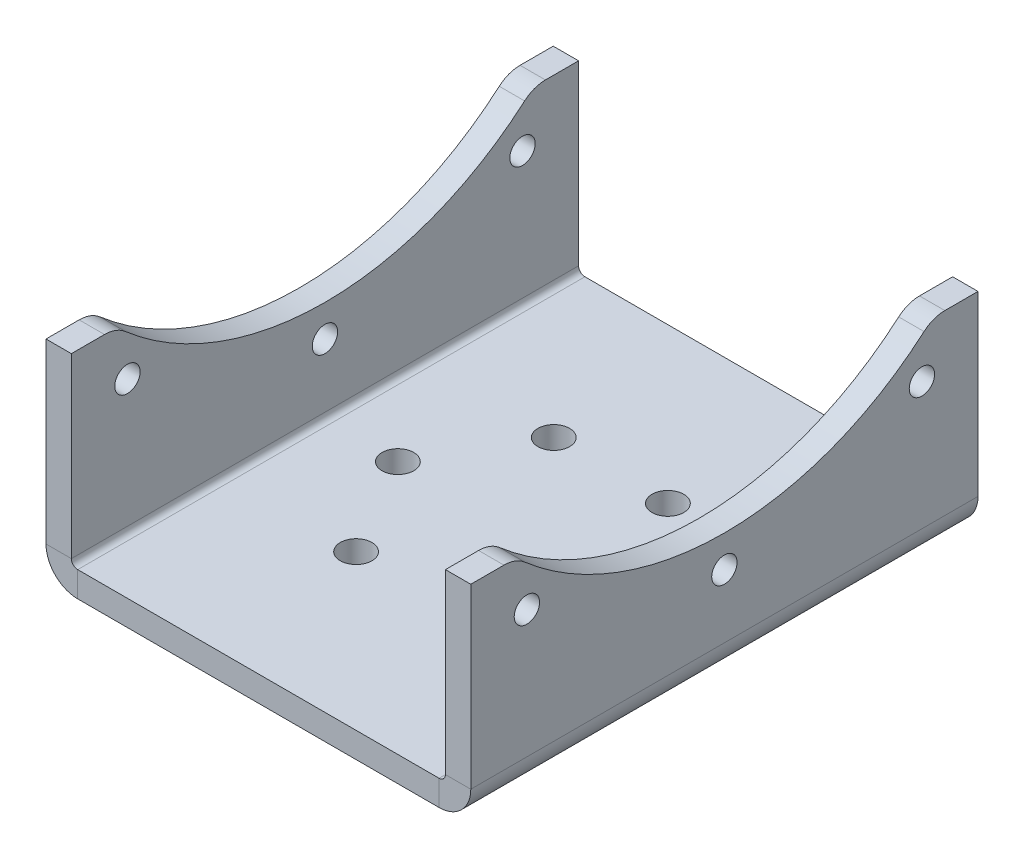
ISO-10303-21;
HEADER;
FILE_DESCRIPTION(('STEP AP214'),'2;1');
FILE_NAME('part.step','',(''),(''),'','','');
FILE_SCHEMA(('AUTOMOTIVE_DESIGN { 1 0 10303 214 1 1 1 1 }'));
ENDSEC;
DATA;
#1=APPLICATION_CONTEXT('core data for automotive mechanical design processes');
#2=APPLICATION_PROTOCOL_DEFINITION('international standard','automotive_design',2000,#1);
#3=PRODUCT_CONTEXT('',#1,'mechanical');
#4=PRODUCT('Part','Part','',(#3));
#5=PRODUCT_RELATED_PRODUCT_CATEGORY('part','',(#4));
#6=PRODUCT_DEFINITION_FORMATION('','',#4);
#7=PRODUCT_DEFINITION_CONTEXT('part definition',#1,'design');
#8=PRODUCT_DEFINITION('design','',#6,#7);
#9=PRODUCT_DEFINITION_SHAPE('','',#8);
#10=(LENGTH_UNIT() NAMED_UNIT(*) SI_UNIT(.MILLI.,.METRE.));
#11=(NAMED_UNIT(*) PLANE_ANGLE_UNIT() SI_UNIT($,.RADIAN.));
#12=(NAMED_UNIT(*) SI_UNIT($,.STERADIAN.) SOLID_ANGLE_UNIT());
#13=UNCERTAINTY_MEASURE_WITH_UNIT(LENGTH_MEASURE(1.E-05),#10,'distance_accuracy_value','');
#14=(GEOMETRIC_REPRESENTATION_CONTEXT(3) GLOBAL_UNCERTAINTY_ASSIGNED_CONTEXT((#13)) GLOBAL_UNIT_ASSIGNED_CONTEXT((#10,
#11,#12)) REPRESENTATION_CONTEXT('',''));
#15=CARTESIAN_POINT('',(0.,0.,0.));
#16=DIRECTION('',(0.,0.,1.));
#17=DIRECTION('',(1.,0.,0.));
#18=AXIS2_PLACEMENT_3D('',#15,#16,#17);
#19=CARTESIAN_POINT('',(-33.5,29.,80.));
#20=DIRECTION('',(0.,1.,0.));
#21=DIRECTION('',(0.,0.,1.));
#22=AXIS2_PLACEMENT_3D('',#19,#20,#21);
#23=PLANE('',#22);
#24=DIRECTION('',(0.,0.,-1.));
#25=VECTOR('',#24,1.);
#26=CARTESIAN_POINT('',(-33.5,29.,80.));
#27=LINE('',#26,#25);
#28=CARTESIAN_POINT('',(-33.5,29.,5.22932269857253));
#29=VERTEX_POINT('',#28);
#30=CARTESIAN_POINT('',(-33.5,29.,0.));
#31=VERTEX_POINT('',#30);
#32=EDGE_CURVE('E346',#29,#31,#27,.T.);
#33=ORIENTED_EDGE('',*,*,#32,.F.);
#34=DIRECTION('',(1.,0.,0.));
#35=VECTOR('',#34,1.);
#36=CARTESIAN_POINT('',(-29.5,29.,5.22932269857253));
#37=LINE('',#36,#35);
#38=CARTESIAN_POINT('',(-29.5,29.,5.22932269857253));
#39=VERTEX_POINT('',#38);
#40=EDGE_CURVE('E412',#29,#39,#37,.T.);
#41=ORIENTED_EDGE('',*,*,#40,.T.);
#42=DIRECTION('',(0.,0.,-1.));
#43=VECTOR('',#42,1.);
#44=CARTESIAN_POINT('',(-29.5,29.,80.));
#45=LINE('',#44,#43);
#46=CARTESIAN_POINT('',(-29.5,29.,0.));
#47=VERTEX_POINT('',#46);
#48=EDGE_CURVE('E209',#39,#47,#45,.T.);
#49=ORIENTED_EDGE('',*,*,#48,.T.);
#50=DIRECTION('',(1.,0.,0.));
#51=VECTOR('',#50,1.);
#52=CARTESIAN_POINT('',(-33.5,29.,0.));
#53=LINE('',#52,#51);
#54=EDGE_CURVE('E263',#31,#47,#53,.T.);
#55=ORIENTED_EDGE('',*,*,#54,.F.);
#56=EDGE_LOOP('',(#33,#41,#49,#55));
#57=FACE_BOUND('',#56,.T.);
#58=ADVANCED_FACE('F46',(#57),#23,.T.);
#59=CARTESIAN_POINT('',(29.5,29.,80.));
#60=DIRECTION('',(0.,1.,0.));
#61=DIRECTION('',(0.,0.,1.));
#62=AXIS2_PLACEMENT_3D('',#59,#60,#61);
#63=PLANE('',#62);
#64=DIRECTION('',(0.,0.,-1.));
#65=VECTOR('',#64,1.);
#66=CARTESIAN_POINT('',(29.5,29.,80.));
#67=LINE('',#66,#65);
#68=CARTESIAN_POINT('',(29.5,29.,5.22932269857251));
#69=VERTEX_POINT('',#68);
#70=CARTESIAN_POINT('',(29.5,29.,0.));
#71=VERTEX_POINT('',#70);
#72=EDGE_CURVE('E321',#69,#71,#67,.T.);
#73=ORIENTED_EDGE('',*,*,#72,.F.);
#74=DIRECTION('',(1.,0.,0.));
#75=VECTOR('',#74,1.);
#76=CARTESIAN_POINT('',(33.5,29.,5.22932269857252));
#77=LINE('',#76,#75);
#78=CARTESIAN_POINT('',(33.5,29.,5.22932269857251));
#79=VERTEX_POINT('',#78);
#80=EDGE_CURVE('E72',#69,#79,#77,.T.);
#81=ORIENTED_EDGE('',*,*,#80,.T.);
#82=DIRECTION('',(0.,0.,-1.));
#83=VECTOR('',#82,1.);
#84=CARTESIAN_POINT('',(33.5,29.,80.));
#85=LINE('',#84,#83);
#86=CARTESIAN_POINT('',(33.5,29.,0.));
#87=VERTEX_POINT('',#86);
#88=EDGE_CURVE('E326',#79,#87,#85,.T.);
#89=ORIENTED_EDGE('',*,*,#88,.T.);
#90=DIRECTION('',(1.,0.,0.));
#91=VECTOR('',#90,1.);
#92=CARTESIAN_POINT('',(29.5,29.,0.));
#93=LINE('',#92,#91);
#94=EDGE_CURVE('E288',#71,#87,#93,.T.);
#95=ORIENTED_EDGE('',*,*,#94,.F.);
#96=EDGE_LOOP('',(#73,#81,#89,#95));
#97=FACE_BOUND('',#96,.T.);
#98=ADVANCED_FACE('F524',(#97),#63,.T.);
#99=CARTESIAN_POINT('',(29.5,1.00000000000001,80.));
#100=DIRECTION('',(0.,0.,1.));
#101=DIRECTION('',(1.,0.,0.));
#102=AXIS2_PLACEMENT_3D('',#99,#100,#101);
#103=PLANE('',#102);
#104=DIRECTION('',(1.,0.,0.));
#105=VECTOR('',#104,1.);
#106=CARTESIAN_POINT('',(29.5,1.00000000000001,80.));
#107=LINE('',#106,#105);
#108=CARTESIAN_POINT('',(29.5,1.00000000000001,80.));
#109=VERTEX_POINT('',#108);
#110=CARTESIAN_POINT('',(33.5,1.,80.));
#111=VERTEX_POINT('',#110);
#112=EDGE_CURVE('E368',#109,#111,#107,.T.);
#113=ORIENTED_EDGE('',*,*,#112,.F.);
#114=CARTESIAN_POINT('',(28.5,1.00000000000001,80.));
#115=DIRECTION('',(0.,0.,1.));
#116=DIRECTION('',(1.,0.,0.));
#117=AXIS2_PLACEMENT_3D('',#114,#115,#116);
#118=CIRCLE('',#117,1.);
#119=CARTESIAN_POINT('',(28.5,0.,80.));
#120=VERTEX_POINT('',#119);
#121=EDGE_CURVE('E247',#109,#120,#118,.F.);
#122=ORIENTED_EDGE('',*,*,#121,.T.);
#123=DIRECTION('',(0.,1.,0.));
#124=VECTOR('',#123,1.);
#125=CARTESIAN_POINT('',(28.5,-3.99999999999999,80.));
#126=LINE('',#125,#124);
#127=CARTESIAN_POINT('',(28.5,-3.99999999999999,80.));
#128=VERTEX_POINT('',#127);
#129=EDGE_CURVE('E365',#128,#120,#126,.T.);
#130=ORIENTED_EDGE('',*,*,#129,.F.);
#131=CARTESIAN_POINT('',(28.5,1.00000000000001,80.));
#132=DIRECTION('',(0.,0.,1.));
#133=DIRECTION('',(1.,0.,0.));
#134=AXIS2_PLACEMENT_3D('',#131,#132,#133);
#135=CIRCLE('',#134,5.);
#136=EDGE_CURVE('E231',#111,#128,#135,.F.);
#137=ORIENTED_EDGE('',*,*,#136,.F.);
#138=EDGE_LOOP('',(#113,#122,#130,#137));
#139=FACE_BOUND('',#138,.T.);
#140=ADVANCED_FACE('F530',(#139),#103,.T.);
#141=CARTESIAN_POINT('',(28.5,-3.99999999999999,80.));
#142=DIRECTION('',(0.,0.,1.));
#143=DIRECTION('',(1.,0.,0.));
#144=AXIS2_PLACEMENT_3D('',#141,#142,#143);
#145=PLANE('',#144);
#146=DIRECTION('',(0.,-1.,0.));
#147=VECTOR('',#146,1.);
#148=CARTESIAN_POINT('',(29.5,0.,80.));
#149=LINE('',#148,#147);
#150=CARTESIAN_POINT('',(29.5,29.,80.));
#151=VERTEX_POINT('',#150);
#152=EDGE_CURVE('E243',#151,#109,#149,.T.);
#153=ORIENTED_EDGE('',*,*,#152,.T.);
#154=ORIENTED_EDGE('',*,*,#112,.T.);
#155=DIRECTION('',(0.,1.,0.));
#156=VECTOR('',#155,1.);
#157=CARTESIAN_POINT('',(33.5,0.,80.));
#158=LINE('',#157,#156);
#159=CARTESIAN_POINT('',(33.5,29.,80.));
#160=VERTEX_POINT('',#159);
#161=EDGE_CURVE('E235',#160,#111,#158,.F.);
#162=ORIENTED_EDGE('',*,*,#161,.F.);
#163=DIRECTION('',(1.,0.,0.));
#164=VECTOR('',#163,1.);
#165=CARTESIAN_POINT('',(29.5,29.,80.));
#166=LINE('',#165,#164);
#167=EDGE_CURVE('E239',#151,#160,#166,.T.);
#168=ORIENTED_EDGE('',*,*,#167,.F.);
#169=EDGE_LOOP('',(#153,#154,#162,#168));
#170=FACE_BOUND('',#169,.T.);
#171=ADVANCED_FACE('F570',(#170),#145,.T.);
#172=CARTESIAN_POINT('',(28.5,0.,0.));
#173=DIRECTION('',(0.,0.,-1.));
#174=DIRECTION('',(-1.,0.,0.));
#175=AXIS2_PLACEMENT_3D('',#172,#173,#174);
#176=PLANE('',#175);
#177=DIRECTION('',(0.,-1.,0.));
#178=VECTOR('',#177,1.);
#179=CARTESIAN_POINT('',(28.5,0.,0.));
#180=LINE('',#179,#178);
#181=CARTESIAN_POINT('',(28.5,0.,0.));
#182=VERTEX_POINT('',#181);
#183=CARTESIAN_POINT('',(28.5,-3.99999999999999,0.));
#184=VERTEX_POINT('',#183);
#185=EDGE_CURVE('E362',#182,#184,#180,.T.);
#186=ORIENTED_EDGE('',*,*,#185,.F.);
#187=CARTESIAN_POINT('',(28.5,1.00000000000001,0.));
#188=DIRECTION('',(0.,0.,1.));
#189=DIRECTION('',(1.,0.,0.));
#190=AXIS2_PLACEMENT_3D('',#187,#188,#189);
#191=CIRCLE('',#190,1.);
#192=CARTESIAN_POINT('',(29.5,1.00000000000001,0.));
#193=VERTEX_POINT('',#192);
#194=EDGE_CURVE('E296',#193,#182,#191,.F.);
#195=ORIENTED_EDGE('',*,*,#194,.F.);
#196=DIRECTION('',(-1.,0.,0.));
#197=VECTOR('',#196,1.);
#198=CARTESIAN_POINT('',(33.5,1.,0.));
#199=LINE('',#198,#197);
#200=CARTESIAN_POINT('',(33.5,1.,0.));
#201=VERTEX_POINT('',#200);
#202=EDGE_CURVE('E359',#201,#193,#199,.T.);
#203=ORIENTED_EDGE('',*,*,#202,.F.);
#204=CARTESIAN_POINT('',(28.5,1.00000000000001,0.));
#205=DIRECTION('',(0.,0.,1.));
#206=DIRECTION('',(1.,0.,0.));
#207=AXIS2_PLACEMENT_3D('',#204,#205,#206);
#208=CIRCLE('',#207,5.);
#209=EDGE_CURVE('E280',#201,#184,#208,.F.);
#210=ORIENTED_EDGE('',*,*,#209,.T.);
#211=EDGE_LOOP('',(#186,#195,#203,#210));
#212=FACE_BOUND('',#211,.T.);
#213=ADVANCED_FACE('F566',(#212),#176,.T.);
#214=CARTESIAN_POINT('',(33.5,1.,0.));
#215=DIRECTION('',(0.,0.,-1.));
#216=DIRECTION('',(-1.,0.,0.));
#217=AXIS2_PLACEMENT_3D('',#214,#215,#216);
#218=PLANE('',#217);
#219=DIRECTION('',(-1.,0.,0.));
#220=VECTOR('',#219,1.);
#221=CARTESIAN_POINT('',(-29.5,0.,0.));
#222=LINE('',#221,#220);
#223=CARTESIAN_POINT('',(-28.5,0.,0.));
#224=VERTEX_POINT('',#223);
#225=EDGE_CURVE('E300',#182,#224,#222,.T.);
#226=ORIENTED_EDGE('',*,*,#225,.F.);
#227=ORIENTED_EDGE('',*,*,#185,.T.);
#228=DIRECTION('',(-1.,0.,0.));
#229=VECTOR('',#228,1.);
#230=CARTESIAN_POINT('',(-29.5,-4.,0.));
#231=LINE('',#230,#229);
#232=CARTESIAN_POINT('',(-28.5,-4.,0.));
#233=VERTEX_POINT('',#232);
#234=EDGE_CURVE('E276',#184,#233,#231,.T.);
#235=ORIENTED_EDGE('',*,*,#234,.T.);
#236=DIRECTION('',(0.,1.,0.));
#237=VECTOR('',#236,1.);
#238=CARTESIAN_POINT('',(-28.5,-4.,0.));
#239=LINE('',#238,#237);
#240=EDGE_CURVE('E208',#233,#224,#239,.T.);
#241=ORIENTED_EDGE('',*,*,#240,.T.);
#242=EDGE_LOOP('',(#226,#227,#235,#241));
#243=FACE_BOUND('',#242,.T.);
#244=ADVANCED_FACE('F562',(#243),#218,.T.);
#245=CARTESIAN_POINT('',(-28.5,0.,80.));
#246=DIRECTION('',(0.,0.,1.));
#247=DIRECTION('',(1.,0.,0.));
#248=AXIS2_PLACEMENT_3D('',#245,#246,#247);
#249=PLANE('',#248);
#250=DIRECTION('',(0.,-1.,0.));
#251=VECTOR('',#250,1.);
#252=CARTESIAN_POINT('',(-28.5,0.,80.));
#253=LINE('',#252,#251);
#254=CARTESIAN_POINT('',(-28.5,0.,80.));
#255=VERTEX_POINT('',#254);
#256=CARTESIAN_POINT('',(-28.5,-4.,80.));
#257=VERTEX_POINT('',#256);
#258=EDGE_CURVE('E356',#255,#257,#253,.T.);
#259=ORIENTED_EDGE('',*,*,#258,.F.);
#260=CARTESIAN_POINT('',(-28.5,1.,80.));
#261=DIRECTION('',(0.,0.,1.));
#262=DIRECTION('',(1.,0.,0.));
#263=AXIS2_PLACEMENT_3D('',#260,#261,#262);
#264=CIRCLE('',#263,1.);
#265=CARTESIAN_POINT('',(-29.5,0.999999999999999,80.));
#266=VERTEX_POINT('',#265);
#267=EDGE_CURVE('E255',#255,#266,#264,.F.);
#268=ORIENTED_EDGE('',*,*,#267,.T.);
#269=DIRECTION('',(1.,0.,0.));
#270=VECTOR('',#269,1.);
#271=CARTESIAN_POINT('',(-33.5,0.999999999999999,80.));
#272=LINE('',#271,#270);
#273=CARTESIAN_POINT('',(-33.5,0.999999999999999,80.));
#274=VERTEX_POINT('',#273);
#275=EDGE_CURVE('E193',#274,#266,#272,.T.);
#276=ORIENTED_EDGE('',*,*,#275,.F.);
#277=CARTESIAN_POINT('',(-28.5,1.,80.));
#278=DIRECTION('',(0.,0.,1.));
#279=DIRECTION('',(1.,0.,0.));
#280=AXIS2_PLACEMENT_3D('',#277,#278,#279);
#281=CIRCLE('',#280,5.);
#282=EDGE_CURVE('E220',#257,#274,#281,.F.);
#283=ORIENTED_EDGE('',*,*,#282,.F.);
#284=EDGE_LOOP('',(#259,#268,#276,#283));
#285=FACE_BOUND('',#284,.T.);
#286=ADVANCED_FACE('F558',(#285),#249,.T.);
#287=CARTESIAN_POINT('',(-33.5,0.999999999999999,80.));
#288=DIRECTION('',(0.,0.,1.));
#289=DIRECTION('',(1.,0.,0.));
#290=AXIS2_PLACEMENT_3D('',#287,#288,#289);
#291=PLANE('',#290);
#292=DIRECTION('',(-1.,0.,0.));
#293=VECTOR('',#292,1.);
#294=CARTESIAN_POINT('',(-29.5,0.,80.));
#295=LINE('',#294,#293);
#296=EDGE_CURVE('E251',#120,#255,#295,.T.);
#297=ORIENTED_EDGE('',*,*,#296,.T.);
#298=ORIENTED_EDGE('',*,*,#258,.T.);
#299=DIRECTION('',(-1.,0.,0.));
#300=VECTOR('',#299,1.);
#301=CARTESIAN_POINT('',(-29.5,-4.,80.));
#302=LINE('',#301,#300);
#303=EDGE_CURVE('E227',#128,#257,#302,.T.);
#304=ORIENTED_EDGE('',*,*,#303,.F.);
#305=ORIENTED_EDGE('',*,*,#129,.T.);
#306=EDGE_LOOP('',(#297,#298,#304,#305));
#307=FACE_BOUND('',#306,.T.);
#308=ADVANCED_FACE('F554',(#307),#291,.T.);
#309=CARTESIAN_POINT('',(-29.5,0.999999999999999,0.));
#310=DIRECTION('',(0.,0.,-1.));
#311=DIRECTION('',(-1.,0.,0.));
#312=AXIS2_PLACEMENT_3D('',#309,#310,#311);
#313=PLANE('',#312);
#314=DIRECTION('',(-1.,0.,0.));
#315=VECTOR('',#314,1.);
#316=CARTESIAN_POINT('',(-29.5,0.999999999999999,0.));
#317=LINE('',#316,#315);
#318=CARTESIAN_POINT('',(-29.5,0.999999999999999,0.));
#319=VERTEX_POINT('',#318);
#320=CARTESIAN_POINT('',(-33.5,0.999999999999999,0.));
#321=VERTEX_POINT('',#320);
#322=EDGE_CURVE('E351',#319,#321,#317,.T.);
#323=ORIENTED_EDGE('',*,*,#322,.F.);
#324=CARTESIAN_POINT('',(-28.5,1.,0.));
#325=DIRECTION('',(0.,0.,1.));
#326=DIRECTION('',(1.,0.,0.));
#327=AXIS2_PLACEMENT_3D('',#324,#325,#326);
#328=CIRCLE('',#327,1.);
#329=EDGE_CURVE('E198',#224,#319,#328,.F.);
#330=ORIENTED_EDGE('',*,*,#329,.F.);
#331=ORIENTED_EDGE('',*,*,#240,.F.);
#332=CARTESIAN_POINT('',(-28.5,1.,0.));
#333=DIRECTION('',(0.,0.,1.));
#334=DIRECTION('',(1.,0.,0.));
#335=AXIS2_PLACEMENT_3D('',#332,#333,#334);
#336=CIRCLE('',#335,5.);
#337=EDGE_CURVE('E272',#233,#321,#336,.F.);
#338=ORIENTED_EDGE('',*,*,#337,.T.);
#339=EDGE_LOOP('',(#323,#330,#331,#338));
#340=FACE_BOUND('',#339,.T.);
#341=ADVANCED_FACE('F548',(#340),#313,.T.);
#342=CARTESIAN_POINT('',(-28.5,-4.,0.));
#343=DIRECTION('',(0.,0.,-1.));
#344=DIRECTION('',(-1.,0.,0.));
#345=AXIS2_PLACEMENT_3D('',#342,#343,#344);
#346=PLANE('',#345);
#347=DIRECTION('',(0.,1.,0.));
#348=VECTOR('',#347,1.);
#349=CARTESIAN_POINT('',(-29.5,0.,0.));
#350=LINE('',#349,#348);
#351=EDGE_CURVE('E259',#319,#47,#350,.T.);
#352=ORIENTED_EDGE('',*,*,#351,.F.);
#353=ORIENTED_EDGE('',*,*,#322,.T.);
#354=DIRECTION('',(0.,1.,0.));
#355=VECTOR('',#354,1.);
#356=CARTESIAN_POINT('',(-33.5,0.,0.));
#357=LINE('',#356,#355);
#358=EDGE_CURVE('E268',#321,#31,#357,.T.);
#359=ORIENTED_EDGE('',*,*,#358,.T.);
#360=ORIENTED_EDGE('',*,*,#54,.T.);
#361=EDGE_LOOP('',(#352,#353,#359,#360));
#362=FACE_BOUND('',#361,.T.);
#363=ADVANCED_FACE('F544',(#362),#346,.T.);
#364=CARTESIAN_POINT('',(-29.5,0.,80.));
#365=DIRECTION('',(-1.,0.,0.));
#366=DIRECTION('',(0.,0.,1.));
#367=AXIS2_PLACEMENT_3D('',#364,#365,#366);
#368=PLANE('',#367);
#369=CARTESIAN_POINT('',(-29.5,21.1220992981278,71.1526183715011));
#370=DIRECTION('',(-1.,0.,0.));
#371=DIRECTION('',(0.,0.,1.));
#372=AXIS2_PLACEMENT_3D('',#369,#370,#371);
#373=CIRCLE('',#372,2.);
#374=CARTESIAN_POINT('',(-29.5,21.1220992981278,73.1526183715011));
#375=VERTEX_POINT('',#374);
#376=EDGE_CURVE('E264',#375,#375,#373,.T.);
#377=ORIENTED_EDGE('',*,*,#376,.T.);
#378=EDGE_LOOP('',(#377));
#379=FACE_BOUND('',#378,.T.);
#380=CARTESIAN_POINT('',(-29.5,21.1220992981278,8.84738162849894));
#381=DIRECTION('',(-1.,0.,0.));
#382=DIRECTION('',(0.,0.,1.));
#383=AXIS2_PLACEMENT_3D('',#380,#381,#382);
#384=CIRCLE('',#383,2.00000000000001);
#385=CARTESIAN_POINT('',(-29.5,21.1220992981278,10.847381628499));
#386=VERTEX_POINT('',#385);
#387=EDGE_CURVE('E386',#386,#386,#384,.T.);
#388=ORIENTED_EDGE('',*,*,#387,.T.);
#389=EDGE_LOOP('',(#388));
#390=FACE_BOUND('',#389,.T.);
#391=CARTESIAN_POINT('',(-29.5,11.,40.));
#392=DIRECTION('',(-1.,0.,0.));
#393=DIRECTION('',(0.,0.,1.));
#394=AXIS2_PLACEMENT_3D('',#391,#392,#393);
#395=CIRCLE('',#394,1.99999999999998);
#396=CARTESIAN_POINT('',(-29.5,11.,42.));
#397=VERTEX_POINT('',#396);
#398=EDGE_CURVE('E380',#397,#397,#395,.T.);
#399=ORIENTED_EDGE('',*,*,#398,.T.);
#400=EDGE_LOOP('',(#399));
#401=FACE_BOUND('',#400,.T.);
#402=CARTESIAN_POINT('',(-29.5,64.,40.));
#403=DIRECTION('',(-1.,0.,0.));
#404=DIRECTION('',(0.,0.,1.));
#405=AXIS2_PLACEMENT_3D('',#402,#403,#404);
#406=CIRCLE('',#405,48.);
#407=CARTESIAN_POINT('',(-29.5,27.7735849056604,8.50957527417889));
#408=VERTEX_POINT('',#407);
#409=CARTESIAN_POINT('',(-29.5,27.7735849056604,71.4904247258211));
#410=VERTEX_POINT('',#409);
#411=EDGE_CURVE('E381',#408,#410,#406,.T.);
#412=ORIENTED_EDGE('',*,*,#411,.T.);
#413=CARTESIAN_POINT('',(-29.5,24.,74.7706773014275));
#414=DIRECTION('',(-1.,0.,0.));
#415=DIRECTION('',(0.,0.,1.));
#416=AXIS2_PLACEMENT_3D('',#413,#414,#415);
#417=CIRCLE('',#416,5.);
#418=CARTESIAN_POINT('',(-29.5,29.,74.7706773014275));
#419=VERTEX_POINT('',#418);
#420=EDGE_CURVE('E204',#410,#419,#417,.F.);
#421=ORIENTED_EDGE('',*,*,#420,.T.);
#422=CARTESIAN_POINT('',(-29.5,29.,80.));
#423=VERTEX_POINT('',#422);
#424=EDGE_CURVE('E201',#423,#419,#45,.T.);
#425=ORIENTED_EDGE('',*,*,#424,.F.);
#426=DIRECTION('',(0.,1.,0.));
#427=VECTOR('',#426,1.);
#428=CARTESIAN_POINT('',(-29.5,0.,80.));
#429=LINE('',#428,#427);
#430=EDGE_CURVE('E186',#266,#423,#429,.T.);
#431=ORIENTED_EDGE('',*,*,#430,.F.);
#432=DIRECTION('',(0.,0.,-1.));
#433=VECTOR('',#432,1.);
#434=CARTESIAN_POINT('',(-29.5,0.999999999999999,80.));
#435=LINE('',#434,#433);
#436=EDGE_CURVE('E258',#266,#319,#435,.T.);
#437=ORIENTED_EDGE('',*,*,#436,.T.);
#438=ORIENTED_EDGE('',*,*,#351,.T.);
#439=ORIENTED_EDGE('',*,*,#48,.F.);
#440=CARTESIAN_POINT('',(-29.5,24.,5.22932269857253));
#441=DIRECTION('',(-1.,0.,0.));
#442=DIRECTION('',(0.,0.,1.));
#443=AXIS2_PLACEMENT_3D('',#440,#441,#442);
#444=CIRCLE('',#443,5.);
#445=EDGE_CURVE('E398',#39,#408,#444,.F.);
#446=ORIENTED_EDGE('',*,*,#445,.T.);
#447=EDGE_LOOP('',(#412,#421,#425,#431,#437,#438,#439,#446));
#448=FACE_BOUND('',#447,.T.);
#449=ADVANCED_FACE('F203',(#379,#390,#401,#448),#368,.F.);
#450=ORIENTED_EDGE('',*,*,#424,.T.);
#451=DIRECTION('',(1.,0.,0.));
#452=VECTOR('',#451,1.);
#453=CARTESIAN_POINT('',(-33.5,29.,74.7706773014275));
#454=LINE('',#453,#452);
#455=CARTESIAN_POINT('',(-33.5,29.,74.7706773014275));
#456=VERTEX_POINT('',#455);
#457=EDGE_CURVE('E403',#419,#456,#454,.F.);
#458=ORIENTED_EDGE('',*,*,#457,.T.);
#459=CARTESIAN_POINT('',(-33.5,29.,80.));
#460=VERTEX_POINT('',#459);
#461=EDGE_CURVE('E213',#460,#456,#27,.T.);
#462=ORIENTED_EDGE('',*,*,#461,.F.);
#463=DIRECTION('',(1.,0.,0.));
#464=VECTOR('',#463,1.);
#465=CARTESIAN_POINT('',(-33.5,29.,80.));
#466=LINE('',#465,#464);
#467=EDGE_CURVE('E191',#460,#423,#466,.T.);
#468=ORIENTED_EDGE('',*,*,#467,.T.);
#469=EDGE_LOOP('',(#450,#458,#462,#468));
#470=FACE_BOUND('',#469,.T.);
#471=ADVANCED_FACE('F211',(#470),#23,.T.);
#472=CARTESIAN_POINT('',(-33.5,0.,80.));
#473=DIRECTION('',(-1.,0.,0.));
#474=DIRECTION('',(0.,0.,1.));
#475=AXIS2_PLACEMENT_3D('',#472,#473,#474);
#476=PLANE('',#475);
#477=CARTESIAN_POINT('',(-33.5,21.1220992981278,71.1526183715011));
#478=DIRECTION('',(-1.,0.,0.));
#479=DIRECTION('',(0.,0.,1.));
#480=AXIS2_PLACEMENT_3D('',#477,#478,#479);
#481=CIRCLE('',#480,2.);
#482=CARTESIAN_POINT('',(-33.5,21.1220992981278,73.1526183715011));
#483=VERTEX_POINT('',#482);
#484=EDGE_CURVE('E460',#483,#483,#481,.T.);
#485=ORIENTED_EDGE('',*,*,#484,.F.);
#486=EDGE_LOOP('',(#485));
#487=FACE_BOUND('',#486,.T.);
#488=CARTESIAN_POINT('',(-33.5,21.1220992981278,8.84738162849894));
#489=DIRECTION('',(-1.,0.,0.));
#490=DIRECTION('',(0.,0.,1.));
#491=AXIS2_PLACEMENT_3D('',#488,#489,#490);
#492=CIRCLE('',#491,2.00000000000001);
#493=CARTESIAN_POINT('',(-33.5,21.1220992981278,10.847381628499));
#494=VERTEX_POINT('',#493);
#495=EDGE_CURVE('E475',#494,#494,#492,.T.);
#496=ORIENTED_EDGE('',*,*,#495,.F.);
#497=EDGE_LOOP('',(#496));
#498=FACE_BOUND('',#497,.T.);
#499=CARTESIAN_POINT('',(-33.5,11.,40.));
#500=DIRECTION('',(-1.,0.,0.));
#501=DIRECTION('',(0.,0.,1.));
#502=AXIS2_PLACEMENT_3D('',#499,#500,#501);
#503=CIRCLE('',#502,1.99999999999998);
#504=CARTESIAN_POINT('',(-33.5,11.,42.));
#505=VERTEX_POINT('',#504);
#506=EDGE_CURVE('E702',#505,#505,#503,.T.);
#507=ORIENTED_EDGE('',*,*,#506,.F.);
#508=EDGE_LOOP('',(#507));
#509=FACE_BOUND('',#508,.T.);
#510=ORIENTED_EDGE('',*,*,#461,.T.);
#511=CARTESIAN_POINT('',(-33.5,24.,74.7706773014275));
#512=DIRECTION('',(-1.,0.,0.));
#513=DIRECTION('',(0.,0.,1.));
#514=AXIS2_PLACEMENT_3D('',#511,#512,#513);
#515=CIRCLE('',#514,5.);
#516=CARTESIAN_POINT('',(-33.5,27.7735849056604,71.4904247258211));
#517=VERTEX_POINT('',#516);
#518=EDGE_CURVE('E409',#456,#517,#515,.T.);
#519=ORIENTED_EDGE('',*,*,#518,.T.);
#520=CARTESIAN_POINT('',(-33.5,64.,40.));
#521=DIRECTION('',(-1.,0.,0.));
#522=DIRECTION('',(0.,0.,1.));
#523=AXIS2_PLACEMENT_3D('',#520,#521,#522);
#524=CIRCLE('',#523,48.);
#525=CARTESIAN_POINT('',(-33.5,27.7735849056604,8.50957527417889));
#526=VERTEX_POINT('',#525);
#527=EDGE_CURVE('E482',#526,#517,#524,.T.);
#528=ORIENTED_EDGE('',*,*,#527,.F.);
#529=CARTESIAN_POINT('',(-33.5,24.,5.22932269857253));
#530=DIRECTION('',(-1.,0.,0.));
#531=DIRECTION('',(0.,0.,1.));
#532=AXIS2_PLACEMENT_3D('',#529,#530,#531);
#533=CIRCLE('',#532,5.);
#534=EDGE_CURVE('E406',#526,#29,#533,.T.);
#535=ORIENTED_EDGE('',*,*,#534,.T.);
#536=ORIENTED_EDGE('',*,*,#32,.T.);
#537=ORIENTED_EDGE('',*,*,#358,.F.);
#538=DIRECTION('',(0.,0.,-1.));
#539=VECTOR('',#538,1.);
#540=CARTESIAN_POINT('',(-33.5,0.999999999999999,80.));
#541=LINE('',#540,#539);
#542=EDGE_CURVE('E342',#274,#321,#541,.T.);
#543=ORIENTED_EDGE('',*,*,#542,.F.);
#544=DIRECTION('',(0.,1.,0.));
#545=VECTOR('',#544,1.);
#546=CARTESIAN_POINT('',(-33.5,0.,80.));
#547=LINE('',#546,#545);
#548=EDGE_CURVE('E215',#274,#460,#547,.T.);
#549=ORIENTED_EDGE('',*,*,#548,.T.);
#550=EDGE_LOOP('',(#510,#519,#528,#535,#536,#537,#543,#549));
#551=FACE_BOUND('',#550,.T.);
#552=ADVANCED_FACE('F537',(#487,#498,#509,#551),#476,.T.);
#553=CARTESIAN_POINT('',(-28.5,1.,80.));
#554=DIRECTION('',(0.,0.,-1.));
#555=DIRECTION('',(-1.,0.,0.));
#556=AXIS2_PLACEMENT_3D('',#553,#554,#555);
#557=CYLINDRICAL_SURFACE('',#556,5.);
#558=ORIENTED_EDGE('',*,*,#337,.F.);
#559=DIRECTION('',(0.,0.,-1.));
#560=VECTOR('',#559,1.);
#561=CARTESIAN_POINT('',(-28.5,-4.,80.));
#562=LINE('',#561,#560);
#563=EDGE_CURVE('E338',#257,#233,#562,.T.);
#564=ORIENTED_EDGE('',*,*,#563,.F.);
#565=ORIENTED_EDGE('',*,*,#282,.T.);
#566=ORIENTED_EDGE('',*,*,#542,.T.);
#567=EDGE_LOOP('',(#558,#564,#565,#566));
#568=FACE_BOUND('',#567,.T.);
#569=ADVANCED_FACE('F542',(#568),#557,.T.);
#570=CARTESIAN_POINT('',(-29.5,-4.,80.));
#571=DIRECTION('',(0.,-1.,0.));
#572=DIRECTION('',(1.,0.,0.));
#573=AXIS2_PLACEMENT_3D('',#570,#571,#572);
#574=PLANE('',#573);
#575=CARTESIAN_POINT('',(18.,-3.99999999999999,40.));
#576=DIRECTION('',(0.,-1.,0.));
#577=DIRECTION('',(1.,0.,0.));
#578=AXIS2_PLACEMENT_3D('',#575,#576,#577);
#579=CIRCLE('',#578,2.5);
#580=CARTESIAN_POINT('',(20.5,-3.99999999999999,40.));
#581=VERTEX_POINT('',#580);
#582=EDGE_CURVE('E440',#581,#581,#579,.T.);
#583=ORIENTED_EDGE('',*,*,#582,.F.);
#584=EDGE_LOOP('',(#583));
#585=FACE_BOUND('',#584,.T.);
#586=CARTESIAN_POINT('',(-9.00000000000001,-4.,24.4115427318801));
#587=DIRECTION('',(0.,-1.,0.));
#588=DIRECTION('',(1.,0.,0.));
#589=AXIS2_PLACEMENT_3D('',#586,#587,#588);
#590=CIRCLE('',#589,2.5);
#591=CARTESIAN_POINT('',(-6.5,-4.,24.4115427318801));
#592=VERTEX_POINT('',#591);
#593=EDGE_CURVE('E757',#592,#592,#590,.T.);
#594=ORIENTED_EDGE('',*,*,#593,.F.);
#595=EDGE_LOOP('',(#594));
#596=FACE_BOUND('',#595,.T.);
#597=CARTESIAN_POINT('',(8.99999999999999,-3.99999999999999,55.5884572681199));
#598=DIRECTION('',(0.,-1.,0.));
#599=DIRECTION('',(1.,0.,0.));
#600=AXIS2_PLACEMENT_3D('',#597,#598,#599);
#601=CIRCLE('',#600,2.5);
#602=CARTESIAN_POINT('',(11.5,-3.99999999999999,55.5884572681199));
#603=VERTEX_POINT('',#602);
#604=EDGE_CURVE('E751',#603,#603,#601,.T.);
#605=ORIENTED_EDGE('',*,*,#604,.F.);
#606=EDGE_LOOP('',(#605));
#607=FACE_BOUND('',#606,.T.);
#608=CARTESIAN_POINT('',(-9.00000000000001,-4.,55.5884572681199));
#609=DIRECTION('',(0.,-1.,0.));
#610=DIRECTION('',(1.,0.,0.));
#611=AXIS2_PLACEMENT_3D('',#608,#609,#610);
#612=CIRCLE('',#611,2.5);
#613=CARTESIAN_POINT('',(-6.50000000000001,-4.,55.5884572681199));
#614=VERTEX_POINT('',#613);
#615=EDGE_CURVE('E745',#614,#614,#612,.T.);
#616=ORIENTED_EDGE('',*,*,#615,.F.);
#617=EDGE_LOOP('',(#616));
#618=FACE_BOUND('',#617,.T.);
#619=CARTESIAN_POINT('',(-18.,-4.,40.));
#620=DIRECTION('',(0.,-1.,0.));
#621=DIRECTION('',(1.,0.,0.));
#622=AXIS2_PLACEMENT_3D('',#619,#620,#621);
#623=CIRCLE('',#622,2.5);
#624=CARTESIAN_POINT('',(-15.5,-4.,40.));
#625=VERTEX_POINT('',#624);
#626=EDGE_CURVE('E739',#625,#625,#623,.T.);
#627=ORIENTED_EDGE('',*,*,#626,.F.);
#628=EDGE_LOOP('',(#627));
#629=FACE_BOUND('',#628,.T.);
#630=CARTESIAN_POINT('',(8.99999999999998,-3.99999999999999,24.4115427318801));
#631=DIRECTION('',(0.,-1.,0.));
#632=DIRECTION('',(1.,0.,0.));
#633=AXIS2_PLACEMENT_3D('',#630,#631,#632);
#634=CIRCLE('',#633,2.5);
#635=CARTESIAN_POINT('',(11.5,-3.99999999999999,24.4115427318801));
#636=VERTEX_POINT('',#635);
#637=EDGE_CURVE('E733',#636,#636,#634,.T.);
#638=ORIENTED_EDGE('',*,*,#637,.F.);
#639=EDGE_LOOP('',(#638));
#640=FACE_BOUND('',#639,.T.);
#641=ORIENTED_EDGE('',*,*,#234,.F.);
#642=DIRECTION('',(0.,0.,-1.));
#643=VECTOR('',#642,1.);
#644=CARTESIAN_POINT('',(28.5,-3.99999999999999,80.));
#645=LINE('',#644,#643);
#646=EDGE_CURVE('E334',#128,#184,#645,.T.);
#647=ORIENTED_EDGE('',*,*,#646,.F.);
#648=ORIENTED_EDGE('',*,*,#303,.T.);
#649=ORIENTED_EDGE('',*,*,#563,.T.);
#650=EDGE_LOOP('',(#641,#647,#648,#649));
#651=FACE_BOUND('',#650,.T.);
#652=ADVANCED_FACE('F769',(#585,#596,#607,#618,#629,#640,#651),#574,.T.);
#653=CARTESIAN_POINT('',(28.5,1.00000000000001,80.));
#654=DIRECTION('',(0.,0.,-1.));
#655=DIRECTION('',(-1.,0.,0.));
#656=AXIS2_PLACEMENT_3D('',#653,#654,#655);
#657=CYLINDRICAL_SURFACE('',#656,5.);
#658=ORIENTED_EDGE('',*,*,#209,.F.);
#659=DIRECTION('',(0.,0.,-1.));
#660=VECTOR('',#659,1.);
#661=CARTESIAN_POINT('',(33.5,1.,80.));
#662=LINE('',#661,#660);
#663=EDGE_CURVE('E330',#111,#201,#662,.T.);
#664=ORIENTED_EDGE('',*,*,#663,.F.);
#665=ORIENTED_EDGE('',*,*,#136,.T.);
#666=ORIENTED_EDGE('',*,*,#646,.T.);
#667=EDGE_LOOP('',(#658,#664,#665,#666));
#668=FACE_BOUND('',#667,.T.);
#669=ADVANCED_FACE('F611',(#668),#657,.T.);
#670=CARTESIAN_POINT('',(33.5,0.,80.));
#671=DIRECTION('',(1.,0.,0.));
#672=DIRECTION('',(0.,0.,-1.));
#673=AXIS2_PLACEMENT_3D('',#670,#671,#672);
#674=PLANE('',#673);
#675=CARTESIAN_POINT('',(33.5,21.1220992981278,71.1526183715011));
#676=DIRECTION('',(-1.,0.,0.));
#677=DIRECTION('',(0.,0.,1.));
#678=AXIS2_PLACEMENT_3D('',#675,#676,#677);
#679=CIRCLE('',#678,2.);
#680=CARTESIAN_POINT('',(33.5,21.1220992981278,73.1526183715011));
#681=VERTEX_POINT('',#680);
#682=EDGE_CURVE('E467',#681,#681,#679,.T.);
#683=ORIENTED_EDGE('',*,*,#682,.T.);
#684=EDGE_LOOP('',(#683));
#685=FACE_BOUND('',#684,.T.);
#686=CARTESIAN_POINT('',(33.5,21.1220992981278,8.84738162849894));
#687=DIRECTION('',(-1.,0.,0.));
#688=DIRECTION('',(0.,0.,1.));
#689=AXIS2_PLACEMENT_3D('',#686,#687,#688);
#690=CIRCLE('',#689,2.00000000000001);
#691=CARTESIAN_POINT('',(33.5,21.1220992981278,10.847381628499));
#692=VERTEX_POINT('',#691);
#693=EDGE_CURVE('E708',#692,#692,#690,.T.);
#694=ORIENTED_EDGE('',*,*,#693,.T.);
#695=EDGE_LOOP('',(#694));
#696=FACE_BOUND('',#695,.T.);
#697=CARTESIAN_POINT('',(33.5,11.,40.));
#698=DIRECTION('',(-1.,0.,0.));
#699=DIRECTION('',(0.,0.,1.));
#700=AXIS2_PLACEMENT_3D('',#697,#698,#699);
#701=CIRCLE('',#700,1.99999999999998);
#702=CARTESIAN_POINT('',(33.5,11.,42.));
#703=VERTEX_POINT('',#702);
#704=EDGE_CURVE('E486',#703,#703,#701,.T.);
#705=ORIENTED_EDGE('',*,*,#704,.T.);
#706=EDGE_LOOP('',(#705));
#707=FACE_BOUND('',#706,.T.);
#708=ORIENTED_EDGE('',*,*,#88,.F.);
#709=CARTESIAN_POINT('',(33.5,24.,5.22932269857252));
#710=DIRECTION('',(1.,0.,0.));
#711=DIRECTION('',(0.,0.,-1.));
#712=AXIS2_PLACEMENT_3D('',#709,#710,#711);
#713=CIRCLE('',#712,5.);
#714=CARTESIAN_POINT('',(33.5,27.7735849056604,8.50957527417889));
#715=VERTEX_POINT('',#714);
#716=EDGE_CURVE('E56',#79,#715,#713,.T.);
#717=ORIENTED_EDGE('',*,*,#716,.T.);
#718=CARTESIAN_POINT('',(33.5,64.,40.));
#719=DIRECTION('',(-1.,0.,0.));
#720=DIRECTION('',(0.,0.,1.));
#721=AXIS2_PLACEMENT_3D('',#718,#719,#720);
#722=CIRCLE('',#721,48.);
#723=CARTESIAN_POINT('',(33.5,27.7735849056604,71.4904247258211));
#724=VERTEX_POINT('',#723);
#725=EDGE_CURVE('E479',#715,#724,#722,.T.);
#726=ORIENTED_EDGE('',*,*,#725,.T.);
#727=CARTESIAN_POINT('',(33.5,24.,74.7706773014275));
#728=DIRECTION('',(1.,0.,0.));
#729=DIRECTION('',(0.,0.,-1.));
#730=AXIS2_PLACEMENT_3D('',#727,#728,#729);
#731=CIRCLE('',#730,5.);
#732=CARTESIAN_POINT('',(33.5,29.,74.7706773014275));
#733=VERTEX_POINT('',#732);
#734=EDGE_CURVE('E64',#724,#733,#731,.T.);
#735=ORIENTED_EDGE('',*,*,#734,.T.);
#736=EDGE_CURVE('E327',#160,#733,#85,.T.);
#737=ORIENTED_EDGE('',*,*,#736,.F.);
#738=ORIENTED_EDGE('',*,*,#161,.T.);
#739=ORIENTED_EDGE('',*,*,#663,.T.);
#740=DIRECTION('',(0.,1.,0.));
#741=VECTOR('',#740,1.);
#742=CARTESIAN_POINT('',(33.5,0.,0.));
#743=LINE('',#742,#741);
#744=EDGE_CURVE('E284',#87,#201,#743,.F.);
#745=ORIENTED_EDGE('',*,*,#744,.F.);
#746=EDGE_LOOP('',(#708,#717,#726,#735,#737,#738,#739,#745));
#747=FACE_BOUND('',#746,.T.);
#748=ADVANCED_FACE('F591',(#685,#696,#707,#747),#674,.T.);
#749=ORIENTED_EDGE('',*,*,#736,.T.);
#750=DIRECTION('',(1.,0.,0.));
#751=VECTOR('',#750,1.);
#752=CARTESIAN_POINT('',(29.5,29.,74.7706773014275));
#753=LINE('',#752,#751);
#754=CARTESIAN_POINT('',(29.5,29.,74.7706773014275));
#755=VERTEX_POINT('',#754);
#756=EDGE_CURVE('E11',#733,#755,#753,.F.);
#757=ORIENTED_EDGE('',*,*,#756,.T.);
#758=EDGE_CURVE('E322',#151,#755,#67,.T.);
#759=ORIENTED_EDGE('',*,*,#758,.F.);
#760=ORIENTED_EDGE('',*,*,#167,.T.);
#761=EDGE_LOOP('',(#749,#757,#759,#760));
#762=FACE_BOUND('',#761,.T.);
#763=ADVANCED_FACE('F532',(#762),#63,.T.);
#764=CARTESIAN_POINT('',(29.5,0.,80.));
#765=DIRECTION('',(1.,0.,0.));
#766=DIRECTION('',(0.,0.,-1.));
#767=AXIS2_PLACEMENT_3D('',#764,#765,#766);
#768=PLANE('',#767);
#769=CARTESIAN_POINT('',(29.5,21.1220992981278,71.1526183715011));
#770=DIRECTION('',(1.,0.,0.));
#771=DIRECTION('',(0.,0.,-1.));
#772=AXIS2_PLACEMENT_3D('',#769,#770,#771);
#773=CIRCLE('',#772,2.);
#774=CARTESIAN_POINT('',(29.5,21.1220992981278,69.1526183715011));
#775=VERTEX_POINT('',#774);
#776=EDGE_CURVE('E387',#775,#775,#773,.T.);
#777=ORIENTED_EDGE('',*,*,#776,.T.);
#778=EDGE_LOOP('',(#777));
#779=FACE_BOUND('',#778,.T.);
#780=CARTESIAN_POINT('',(29.5,21.1220992981278,8.84738162849894));
#781=DIRECTION('',(1.,0.,0.));
#782=DIRECTION('',(0.,0.,-1.));
#783=AXIS2_PLACEMENT_3D('',#780,#781,#782);
#784=CIRCLE('',#783,2.00000000000001);
#785=CARTESIAN_POINT('',(29.5,21.1220992981278,6.84738162849893));
#786=VERTEX_POINT('',#785);
#787=EDGE_CURVE('E382',#786,#786,#784,.T.);
#788=ORIENTED_EDGE('',*,*,#787,.T.);
#789=EDGE_LOOP('',(#788));
#790=FACE_BOUND('',#789,.T.);
#791=CARTESIAN_POINT('',(29.5,11.,40.));
#792=DIRECTION('',(1.,0.,0.));
#793=DIRECTION('',(0.,0.,-1.));
#794=AXIS2_PLACEMENT_3D('',#791,#792,#793);
#795=CIRCLE('',#794,1.99999999999998);
#796=CARTESIAN_POINT('',(29.5,11.,38.));
#797=VERTEX_POINT('',#796);
#798=EDGE_CURVE('E376',#797,#797,#795,.T.);
#799=ORIENTED_EDGE('',*,*,#798,.T.);
#800=EDGE_LOOP('',(#799));
#801=FACE_BOUND('',#800,.T.);
#802=CARTESIAN_POINT('',(29.5,64.,40.));
#803=DIRECTION('',(1.,0.,0.));
#804=DIRECTION('',(0.,0.,-1.));
#805=AXIS2_PLACEMENT_3D('',#802,#803,#804);
#806=CIRCLE('',#805,48.);
#807=CARTESIAN_POINT('',(29.5,27.7735849056604,71.4904247258211));
#808=VERTEX_POINT('',#807);
#809=CARTESIAN_POINT('',(29.5,27.7735849056604,8.50957527417889));
#810=VERTEX_POINT('',#809);
#811=EDGE_CURVE('E371',#808,#810,#806,.T.);
#812=ORIENTED_EDGE('',*,*,#811,.T.);
#813=CARTESIAN_POINT('',(29.5,24.,5.22932269857252));
#814=DIRECTION('',(1.,0.,0.));
#815=DIRECTION('',(0.,0.,-1.));
#816=AXIS2_PLACEMENT_3D('',#813,#814,#815);
#817=CIRCLE('',#816,5.);
#818=EDGE_CURVE('E426',#810,#69,#817,.F.);
#819=ORIENTED_EDGE('',*,*,#818,.T.);
#820=ORIENTED_EDGE('',*,*,#72,.T.);
#821=DIRECTION('',(0.,-1.,0.));
#822=VECTOR('',#821,1.);
#823=CARTESIAN_POINT('',(29.5,0.,0.));
#824=LINE('',#823,#822);
#825=EDGE_CURVE('E292',#71,#193,#824,.T.);
#826=ORIENTED_EDGE('',*,*,#825,.T.);
#827=DIRECTION('',(0.,0.,-1.));
#828=VECTOR('',#827,1.);
#829=CARTESIAN_POINT('',(29.5,1.00000000000001,80.));
#830=LINE('',#829,#828);
#831=EDGE_CURVE('E317',#109,#193,#830,.T.);
#832=ORIENTED_EDGE('',*,*,#831,.F.);
#833=ORIENTED_EDGE('',*,*,#152,.F.);
#834=ORIENTED_EDGE('',*,*,#758,.T.);
#835=CARTESIAN_POINT('',(29.5,24.,74.7706773014275));
#836=DIRECTION('',(1.,0.,0.));
#837=DIRECTION('',(0.,0.,-1.));
#838=AXIS2_PLACEMENT_3D('',#835,#836,#837);
#839=CIRCLE('',#838,5.);
#840=EDGE_CURVE('E423',#755,#808,#839,.F.);
#841=ORIENTED_EDGE('',*,*,#840,.T.);
#842=EDGE_LOOP('',(#812,#819,#820,#826,#832,#833,#834,#841));
#843=FACE_BOUND('',#842,.T.);
#844=ADVANCED_FACE('F602',(#779,#790,#801,#843),#768,.F.);
#845=CARTESIAN_POINT('',(28.5,1.00000000000001,80.));
#846=DIRECTION('',(0.,0.,-1.));
#847=DIRECTION('',(-1.,0.,0.));
#848=AXIS2_PLACEMENT_3D('',#845,#846,#847);
#849=CYLINDRICAL_SURFACE('',#848,1.);
#850=ORIENTED_EDGE('',*,*,#194,.T.);
#851=DIRECTION('',(0.,0.,-1.));
#852=VECTOR('',#851,1.);
#853=CARTESIAN_POINT('',(28.5,0.,80.));
#854=LINE('',#853,#852);
#855=EDGE_CURVE('E313',#120,#182,#854,.T.);
#856=ORIENTED_EDGE('',*,*,#855,.F.);
#857=ORIENTED_EDGE('',*,*,#121,.F.);
#858=ORIENTED_EDGE('',*,*,#831,.T.);
#859=EDGE_LOOP('',(#850,#856,#857,#858));
#860=FACE_BOUND('',#859,.T.);
#861=ADVANCED_FACE('F789',(#860),#849,.F.);
#862=CARTESIAN_POINT('',(-29.5,0.,80.));
#863=DIRECTION('',(0.,-1.,0.));
#864=DIRECTION('',(1.,0.,0.));
#865=AXIS2_PLACEMENT_3D('',#862,#863,#864);
#866=PLANE('',#865);
#867=CARTESIAN_POINT('',(18.,0.,40.));
#868=DIRECTION('',(0.,-1.,0.));
#869=DIRECTION('',(1.,0.,0.));
#870=AXIS2_PLACEMENT_3D('',#867,#868,#869);
#871=CIRCLE('',#870,2.5);
#872=CARTESIAN_POINT('',(20.5,0.,40.));
#873=VERTEX_POINT('',#872);
#874=EDGE_CURVE('E50',#873,#873,#871,.T.);
#875=ORIENTED_EDGE('',*,*,#874,.T.);
#876=EDGE_LOOP('',(#875));
#877=FACE_BOUND('',#876,.T.);
#878=CARTESIAN_POINT('',(-9.00000000000001,0.,24.4115427318801));
#879=DIRECTION('',(0.,-1.,0.));
#880=DIRECTION('',(1.,0.,0.));
#881=AXIS2_PLACEMENT_3D('',#878,#879,#880);
#882=CIRCLE('',#881,2.5);
#883=CARTESIAN_POINT('',(-6.5,0.,24.4115427318801));
#884=VERTEX_POINT('',#883);
#885=EDGE_CURVE('E451',#884,#884,#882,.T.);
#886=ORIENTED_EDGE('',*,*,#885,.T.);
#887=EDGE_LOOP('',(#886));
#888=FACE_BOUND('',#887,.T.);
#889=CARTESIAN_POINT('',(8.99999999999999,0.,55.5884572681199));
#890=DIRECTION('',(0.,-1.,0.));
#891=DIRECTION('',(1.,0.,0.));
#892=AXIS2_PLACEMENT_3D('',#889,#890,#891);
#893=CIRCLE('',#892,2.5);
#894=CARTESIAN_POINT('',(11.5,0.,55.5884572681199));
#895=VERTEX_POINT('',#894);
#896=EDGE_CURVE('E448',#895,#895,#893,.T.);
#897=ORIENTED_EDGE('',*,*,#896,.T.);
#898=EDGE_LOOP('',(#897));
#899=FACE_BOUND('',#898,.T.);
#900=CARTESIAN_POINT('',(-9.00000000000001,0.,55.5884572681199));
#901=DIRECTION('',(0.,-1.,0.));
#902=DIRECTION('',(1.,0.,0.));
#903=AXIS2_PLACEMENT_3D('',#900,#901,#902);
#904=CIRCLE('',#903,2.5);
#905=CARTESIAN_POINT('',(-6.50000000000001,0.,55.5884572681199));
#906=VERTEX_POINT('',#905);
#907=EDGE_CURVE('E444',#906,#906,#904,.T.);
#908=ORIENTED_EDGE('',*,*,#907,.T.);
#909=EDGE_LOOP('',(#908));
#910=FACE_BOUND('',#909,.T.);
#911=CARTESIAN_POINT('',(-18.,0.,40.));
#912=DIRECTION('',(0.,-1.,0.));
#913=DIRECTION('',(1.,0.,0.));
#914=AXIS2_PLACEMENT_3D('',#911,#912,#913);
#915=CIRCLE('',#914,2.5);
#916=CARTESIAN_POINT('',(-15.5,0.,40.));
#917=VERTEX_POINT('',#916);
#918=EDGE_CURVE('E439',#917,#917,#915,.T.);
#919=ORIENTED_EDGE('',*,*,#918,.T.);
#920=EDGE_LOOP('',(#919));
#921=FACE_BOUND('',#920,.T.);
#922=CARTESIAN_POINT('',(8.99999999999998,0.,24.4115427318801));
#923=DIRECTION('',(0.,-1.,0.));
#924=DIRECTION('',(1.,0.,0.));
#925=AXIS2_PLACEMENT_3D('',#922,#923,#924);
#926=CIRCLE('',#925,2.5);
#927=CARTESIAN_POINT('',(11.5,0.,24.4115427318801));
#928=VERTEX_POINT('',#927);
#929=EDGE_CURVE('E435',#928,#928,#926,.T.);
#930=ORIENTED_EDGE('',*,*,#929,.T.);
#931=EDGE_LOOP('',(#930));
#932=FACE_BOUND('',#931,.T.);
#933=ORIENTED_EDGE('',*,*,#225,.T.);
#934=DIRECTION('',(0.,0.,-1.));
#935=VECTOR('',#934,1.);
#936=CARTESIAN_POINT('',(-28.5,0.,80.));
#937=LINE('',#936,#935);
#938=EDGE_CURVE('E309',#255,#224,#937,.T.);
#939=ORIENTED_EDGE('',*,*,#938,.F.);
#940=ORIENTED_EDGE('',*,*,#296,.F.);
#941=ORIENTED_EDGE('',*,*,#855,.T.);
#942=EDGE_LOOP('',(#933,#939,#940,#941));
#943=FACE_BOUND('',#942,.T.);
#944=ADVANCED_FACE('F792',(#877,#888,#899,#910,#921,#932,#943),#866,.F.);
#945=CARTESIAN_POINT('',(-28.5,1.,80.));
#946=DIRECTION('',(0.,0.,-1.));
#947=DIRECTION('',(-1.,0.,0.));
#948=AXIS2_PLACEMENT_3D('',#945,#946,#947);
#949=CYLINDRICAL_SURFACE('',#948,1.);
#950=ORIENTED_EDGE('',*,*,#329,.T.);
#951=ORIENTED_EDGE('',*,*,#436,.F.);
#952=ORIENTED_EDGE('',*,*,#267,.F.);
#953=ORIENTED_EDGE('',*,*,#938,.T.);
#954=EDGE_LOOP('',(#950,#951,#952,#953));
#955=FACE_BOUND('',#954,.T.);
#956=ADVANCED_FACE('F804',(#955),#949,.F.);
#957=CARTESIAN_POINT('',(-28.5,1.,80.));
#958=DIRECTION('',(0.,0.,1.));
#959=DIRECTION('',(1.,0.,0.));
#960=AXIS2_PLACEMENT_3D('',#957,#958,#959);
#961=PLANE('',#960);
#962=ORIENTED_EDGE('',*,*,#430,.T.);
#963=ORIENTED_EDGE('',*,*,#467,.F.);
#964=ORIENTED_EDGE('',*,*,#548,.F.);
#965=ORIENTED_EDGE('',*,*,#275,.T.);
#966=EDGE_LOOP('',(#962,#963,#964,#965));
#967=FACE_BOUND('',#966,.T.);
#968=ADVANCED_FACE('F188',(#967),#961,.T.);
#969=CARTESIAN_POINT('',(-28.5,1.,0.));
#970=DIRECTION('',(0.,0.,1.));
#971=DIRECTION('',(1.,0.,0.));
#972=AXIS2_PLACEMENT_3D('',#969,#970,#971);
#973=PLANE('',#972);
#974=ORIENTED_EDGE('',*,*,#744,.T.);
#975=ORIENTED_EDGE('',*,*,#202,.T.);
#976=ORIENTED_EDGE('',*,*,#825,.F.);
#977=ORIENTED_EDGE('',*,*,#94,.T.);
#978=EDGE_LOOP('',(#974,#975,#976,#977));
#979=FACE_BOUND('',#978,.T.);
#980=ADVANCED_FACE('F615',(#979),#973,.F.);
#981=CARTESIAN_POINT('',(33.5,64.,40.));
#982=DIRECTION('',(-1.,0.,0.));
#983=DIRECTION('',(0.,0.,1.));
#984=AXIS2_PLACEMENT_3D('',#981,#982,#983);
#985=CYLINDRICAL_SURFACE('',#984,48.);
#986=ORIENTED_EDGE('',*,*,#725,.F.);
#987=DIRECTION('',(-1.,0.,0.));
#988=VECTOR('',#987,1.);
#989=CARTESIAN_POINT('',(33.5,27.7735849056604,8.50957527417889));
#990=LINE('',#989,#988);
#991=EDGE_CURVE('E419',#715,#810,#990,.T.);
#992=ORIENTED_EDGE('',*,*,#991,.T.);
#993=ORIENTED_EDGE('',*,*,#811,.F.);
#994=DIRECTION('',(-1.,0.,0.));
#995=VECTOR('',#994,1.);
#996=CARTESIAN_POINT('',(33.5,27.7735849056604,71.4904247258211));
#997=LINE('',#996,#995);
#998=EDGE_CURVE('E415',#808,#724,#997,.F.);
#999=ORIENTED_EDGE('',*,*,#998,.T.);
#1000=EDGE_LOOP('',(#986,#992,#993,#999));
#1001=FACE_BOUND('',#1000,.T.);
#1002=ADVANCED_FACE('F594',(#1001),#985,.F.);
#1003=CARTESIAN_POINT('',(33.5,11.,40.));
#1004=DIRECTION('',(-1.,0.,0.));
#1005=DIRECTION('',(0.,0.,1.));
#1006=AXIS2_PLACEMENT_3D('',#1003,#1004,#1005);
#1007=CYLINDRICAL_SURFACE('',#1006,1.99999999999998);
#1008=ORIENTED_EDGE('',*,*,#704,.F.);
#1009=EDGE_LOOP('',(#1008));
#1010=FACE_BOUND('',#1009,.T.);
#1011=ORIENTED_EDGE('',*,*,#798,.F.);
#1012=EDGE_LOOP('',(#1011));
#1013=FACE_BOUND('',#1012,.T.);
#1014=ADVANCED_FACE('F889',(#1010,#1013),#1007,.F.);
#1015=CARTESIAN_POINT('',(33.5,21.1220992981278,8.84738162849894));
#1016=DIRECTION('',(-1.,0.,0.));
#1017=DIRECTION('',(0.,0.,1.));
#1018=AXIS2_PLACEMENT_3D('',#1015,#1016,#1017);
#1019=CYLINDRICAL_SURFACE('',#1018,2.00000000000001);
#1020=ORIENTED_EDGE('',*,*,#693,.F.);
#1021=EDGE_LOOP('',(#1020));
#1022=FACE_BOUND('',#1021,.T.);
#1023=ORIENTED_EDGE('',*,*,#787,.F.);
#1024=EDGE_LOOP('',(#1023));
#1025=FACE_BOUND('',#1024,.T.);
#1026=ADVANCED_FACE('F518',(#1022,#1025),#1019,.F.);
#1027=CARTESIAN_POINT('',(33.5,21.1220992981278,71.1526183715011));
#1028=DIRECTION('',(-1.,0.,0.));
#1029=DIRECTION('',(0.,0.,1.));
#1030=AXIS2_PLACEMENT_3D('',#1027,#1028,#1029);
#1031=CYLINDRICAL_SURFACE('',#1030,2.);
#1032=ORIENTED_EDGE('',*,*,#682,.F.);
#1033=EDGE_LOOP('',(#1032));
#1034=FACE_BOUND('',#1033,.T.);
#1035=ORIENTED_EDGE('',*,*,#776,.F.);
#1036=EDGE_LOOP('',(#1035));
#1037=FACE_BOUND('',#1036,.T.);
#1038=ADVANCED_FACE('F507',(#1034,#1037),#1031,.F.);
#1039=ORIENTED_EDGE('',*,*,#527,.T.);
#1040=DIRECTION('',(-1.,0.,0.));
#1041=VECTOR('',#1040,1.);
#1042=CARTESIAN_POINT('',(33.5,27.7735849056604,71.4904247258211));
#1043=LINE('',#1042,#1041);
#1044=EDGE_CURVE('E394',#517,#410,#1043,.F.);
#1045=ORIENTED_EDGE('',*,*,#1044,.T.);
#1046=ORIENTED_EDGE('',*,*,#411,.F.);
#1047=DIRECTION('',(-1.,0.,0.));
#1048=VECTOR('',#1047,1.);
#1049=CARTESIAN_POINT('',(33.5,27.7735849056604,8.50957527417889));
#1050=LINE('',#1049,#1048);
#1051=EDGE_CURVE('E375',#408,#526,#1050,.T.);
#1052=ORIENTED_EDGE('',*,*,#1051,.T.);
#1053=EDGE_LOOP('',(#1039,#1045,#1046,#1052));
#1054=FACE_BOUND('',#1053,.T.);
#1055=ADVANCED_FACE('F521',(#1054),#985,.F.);
#1056=ORIENTED_EDGE('',*,*,#506,.T.);
#1057=EDGE_LOOP('',(#1056));
#1058=FACE_BOUND('',#1057,.T.);
#1059=ORIENTED_EDGE('',*,*,#398,.F.);
#1060=EDGE_LOOP('',(#1059));
#1061=FACE_BOUND('',#1060,.T.);
#1062=ADVANCED_FACE('F515',(#1058,#1061),#1007,.F.);
#1063=ORIENTED_EDGE('',*,*,#495,.T.);
#1064=EDGE_LOOP('',(#1063));
#1065=FACE_BOUND('',#1064,.T.);
#1066=ORIENTED_EDGE('',*,*,#387,.F.);
#1067=EDGE_LOOP('',(#1066));
#1068=FACE_BOUND('',#1067,.T.);
#1069=ADVANCED_FACE('F505',(#1065,#1068),#1019,.F.);
#1070=ORIENTED_EDGE('',*,*,#484,.T.);
#1071=EDGE_LOOP('',(#1070));
#1072=FACE_BOUND('',#1071,.T.);
#1073=ORIENTED_EDGE('',*,*,#376,.F.);
#1074=EDGE_LOOP('',(#1073));
#1075=FACE_BOUND('',#1074,.T.);
#1076=ADVANCED_FACE('F502',(#1072,#1075),#1031,.F.);
#1077=CARTESIAN_POINT('',(33.5,24.,74.7706773014275));
#1078=DIRECTION('',(-1.,0.,0.));
#1079=DIRECTION('',(0.,0.,1.));
#1080=AXIS2_PLACEMENT_3D('',#1077,#1078,#1079);
#1081=CYLINDRICAL_SURFACE('',#1080,5.);
#1082=ORIENTED_EDGE('',*,*,#518,.F.);
#1083=ORIENTED_EDGE('',*,*,#457,.F.);
#1084=ORIENTED_EDGE('',*,*,#420,.F.);
#1085=ORIENTED_EDGE('',*,*,#1044,.F.);
#1086=EDGE_LOOP('',(#1082,#1083,#1084,#1085));
#1087=FACE_BOUND('',#1086,.T.);
#1088=ADVANCED_FACE('F504',(#1087),#1081,.T.);
#1089=CARTESIAN_POINT('',(33.5,24.,5.22932269857253));
#1090=DIRECTION('',(-1.,0.,0.));
#1091=DIRECTION('',(0.,0.,1.));
#1092=AXIS2_PLACEMENT_3D('',#1089,#1090,#1091);
#1093=CYLINDRICAL_SURFACE('',#1092,5.);
#1094=ORIENTED_EDGE('',*,*,#445,.F.);
#1095=ORIENTED_EDGE('',*,*,#40,.F.);
#1096=ORIENTED_EDGE('',*,*,#534,.F.);
#1097=ORIENTED_EDGE('',*,*,#1051,.F.);
#1098=EDGE_LOOP('',(#1094,#1095,#1096,#1097));
#1099=FACE_BOUND('',#1098,.T.);
#1100=ADVANCED_FACE('F512',(#1099),#1093,.T.);
#1101=CARTESIAN_POINT('',(33.5,24.,5.22932269857252));
#1102=DIRECTION('',(-1.,0.,0.));
#1103=DIRECTION('',(0.,0.,1.));
#1104=AXIS2_PLACEMENT_3D('',#1101,#1102,#1103);
#1105=CYLINDRICAL_SURFACE('',#1104,5.);
#1106=ORIENTED_EDGE('',*,*,#716,.F.);
#1107=ORIENTED_EDGE('',*,*,#80,.F.);
#1108=ORIENTED_EDGE('',*,*,#818,.F.);
#1109=ORIENTED_EDGE('',*,*,#991,.F.);
#1110=EDGE_LOOP('',(#1106,#1107,#1108,#1109));
#1111=FACE_BOUND('',#1110,.T.);
#1112=ADVANCED_FACE('F579',(#1111),#1105,.T.);
#1113=CARTESIAN_POINT('',(33.5,24.,74.7706773014275));
#1114=DIRECTION('',(-1.,0.,0.));
#1115=DIRECTION('',(0.,0.,1.));
#1116=AXIS2_PLACEMENT_3D('',#1113,#1114,#1115);
#1117=CYLINDRICAL_SURFACE('',#1116,5.);
#1118=ORIENTED_EDGE('',*,*,#840,.F.);
#1119=ORIENTED_EDGE('',*,*,#756,.F.);
#1120=ORIENTED_EDGE('',*,*,#734,.F.);
#1121=ORIENTED_EDGE('',*,*,#998,.F.);
#1122=EDGE_LOOP('',(#1118,#1119,#1120,#1121));
#1123=FACE_BOUND('',#1122,.T.);
#1124=ADVANCED_FACE('F48',(#1123),#1117,.T.);
#1125=CARTESIAN_POINT('',(8.99999999999998,29.,24.4115427318801));
#1126=DIRECTION('',(0.,-1.,0.));
#1127=DIRECTION('',(1.,0.,0.));
#1128=AXIS2_PLACEMENT_3D('',#1125,#1126,#1127);
#1129=CYLINDRICAL_SURFACE('',#1128,2.5);
#1130=ORIENTED_EDGE('',*,*,#637,.T.);
#1131=EDGE_LOOP('',(#1130));
#1132=FACE_BOUND('',#1131,.T.);
#1133=ORIENTED_EDGE('',*,*,#929,.F.);
#1134=EDGE_LOOP('',(#1133));
#1135=FACE_BOUND('',#1134,.T.);
#1136=ADVANCED_FACE('F586',(#1132,#1135),#1129,.F.);
#1137=CARTESIAN_POINT('',(-18.,29.,40.));
#1138=DIRECTION('',(0.,-1.,0.));
#1139=DIRECTION('',(1.,0.,0.));
#1140=AXIS2_PLACEMENT_3D('',#1137,#1138,#1139);
#1141=CYLINDRICAL_SURFACE('',#1140,2.5);
#1142=ORIENTED_EDGE('',*,*,#626,.T.);
#1143=EDGE_LOOP('',(#1142));
#1144=FACE_BOUND('',#1143,.T.);
#1145=ORIENTED_EDGE('',*,*,#918,.F.);
#1146=EDGE_LOOP('',(#1145));
#1147=FACE_BOUND('',#1146,.T.);
#1148=ADVANCED_FACE('F1038',(#1144,#1147),#1141,.F.);
#1149=CARTESIAN_POINT('',(-9.00000000000002,29.,55.5884572681199));
#1150=DIRECTION('',(0.,-1.,0.));
#1151=DIRECTION('',(1.,0.,0.));
#1152=AXIS2_PLACEMENT_3D('',#1149,#1150,#1151);
#1153=CYLINDRICAL_SURFACE('',#1152,2.5);
#1154=ORIENTED_EDGE('',*,*,#615,.T.);
#1155=EDGE_LOOP('',(#1154));
#1156=FACE_BOUND('',#1155,.T.);
#1157=ORIENTED_EDGE('',*,*,#907,.F.);
#1158=EDGE_LOOP('',(#1157));
#1159=FACE_BOUND('',#1158,.T.);
#1160=ADVANCED_FACE('F1048',(#1156,#1159),#1153,.F.);
#1161=CARTESIAN_POINT('',(8.99999999999998,29.,55.5884572681199));
#1162=DIRECTION('',(0.,-1.,0.));
#1163=DIRECTION('',(1.,0.,0.));
#1164=AXIS2_PLACEMENT_3D('',#1161,#1162,#1163);
#1165=CYLINDRICAL_SURFACE('',#1164,2.5);
#1166=ORIENTED_EDGE('',*,*,#604,.T.);
#1167=EDGE_LOOP('',(#1166));
#1168=FACE_BOUND('',#1167,.T.);
#1169=ORIENTED_EDGE('',*,*,#896,.F.);
#1170=EDGE_LOOP('',(#1169));
#1171=FACE_BOUND('',#1170,.T.);
#1172=ADVANCED_FACE('F1058',(#1168,#1171),#1165,.F.);
#1173=CARTESIAN_POINT('',(-9.00000000000001,29.,24.4115427318801));
#1174=DIRECTION('',(0.,-1.,0.));
#1175=DIRECTION('',(1.,0.,0.));
#1176=AXIS2_PLACEMENT_3D('',#1173,#1174,#1175);
#1177=CYLINDRICAL_SURFACE('',#1176,2.5);
#1178=ORIENTED_EDGE('',*,*,#593,.T.);
#1179=EDGE_LOOP('',(#1178));
#1180=FACE_BOUND('',#1179,.T.);
#1181=ORIENTED_EDGE('',*,*,#885,.F.);
#1182=EDGE_LOOP('',(#1181));
#1183=FACE_BOUND('',#1182,.T.);
#1184=ADVANCED_FACE('F766',(#1180,#1183),#1177,.F.);
#1185=CARTESIAN_POINT('',(18.,29.,40.));
#1186=DIRECTION('',(0.,-1.,0.));
#1187=DIRECTION('',(1.,0.,0.));
#1188=AXIS2_PLACEMENT_3D('',#1185,#1186,#1187);
#1189=CYLINDRICAL_SURFACE('',#1188,2.5);
#1190=ORIENTED_EDGE('',*,*,#582,.T.);
#1191=EDGE_LOOP('',(#1190));
#1192=FACE_BOUND('',#1191,.T.);
#1193=ORIENTED_EDGE('',*,*,#874,.F.);
#1194=EDGE_LOOP('',(#1193));
#1195=FACE_BOUND('',#1194,.T.);
#1196=ADVANCED_FACE('F1077',(#1192,#1195),#1189,.F.);
#1197=CLOSED_SHELL('',(#58,#98,#140,#171,#213,#244,#286,#308,#341,#363,#449,#471,#552,#569,#652,
#669,#748,#763,#844,#861,#944,#956,#968,#980,#1002,#1014,#1026,#1038,#1055,#1062,#1069,#1076,
#1088,#1100,#1112,#1124,#1136,#1148,#1160,#1172,#1184,#1196));
#1198=MANIFOLD_SOLID_BREP('B2',#1197);
#1199=ADVANCED_BREP_SHAPE_REPRESENTATION('',(#18,#1198),#14);
#1200=SHAPE_DEFINITION_REPRESENTATION(#9,#1199);
ENDSEC;
END-ISO-10303-21;
